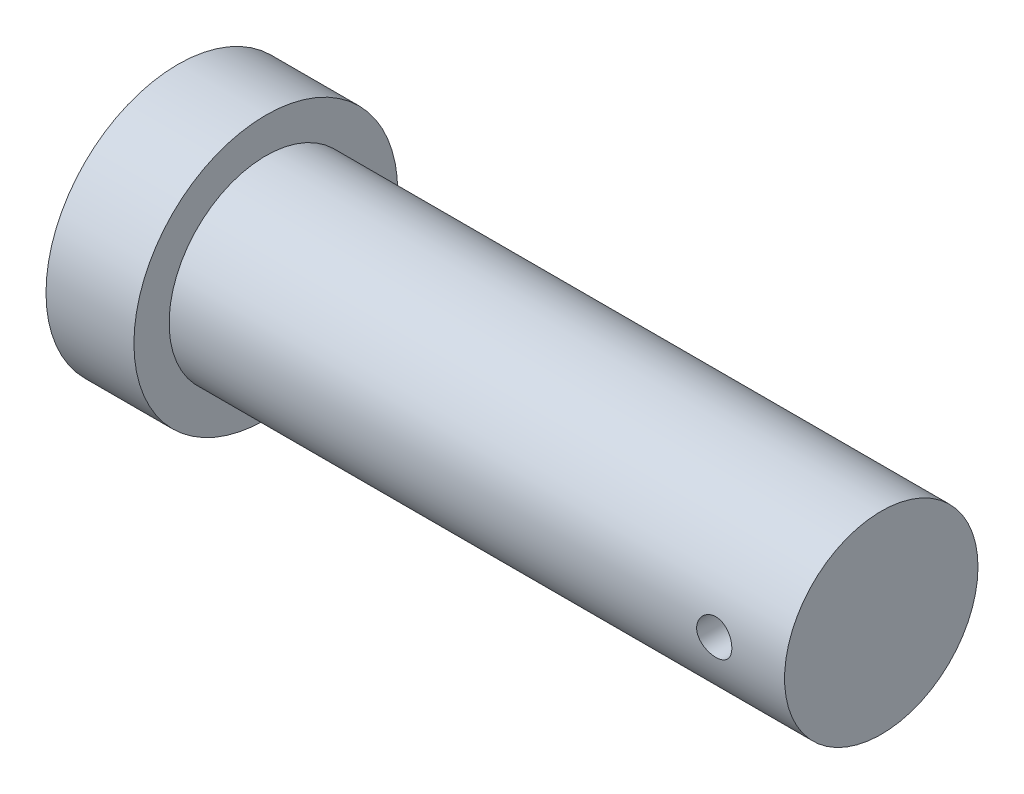
ISO-10303-21;
HEADER;
FILE_DESCRIPTION(('STEP AP214'),'2;1');
FILE_NAME('part.step','',(''),(''),'','','');
FILE_SCHEMA(('AUTOMOTIVE_DESIGN { 1 0 10303 214 1 1 1 1 }'));
ENDSEC;
DATA;
#1=APPLICATION_CONTEXT('core data for automotive mechanical design processes');
#2=APPLICATION_PROTOCOL_DEFINITION('international standard','automotive_design',2000,#1);
#3=PRODUCT_CONTEXT('',#1,'mechanical');
#4=PRODUCT('Part','Part','',(#3));
#5=PRODUCT_RELATED_PRODUCT_CATEGORY('part','',(#4));
#6=PRODUCT_DEFINITION_FORMATION('','',#4);
#7=PRODUCT_DEFINITION_CONTEXT('part definition',#1,'design');
#8=PRODUCT_DEFINITION('design','',#6,#7);
#9=PRODUCT_DEFINITION_SHAPE('','',#8);
#10=(LENGTH_UNIT() NAMED_UNIT(*) SI_UNIT(.MILLI.,.METRE.));
#11=(NAMED_UNIT(*) PLANE_ANGLE_UNIT() SI_UNIT($,.RADIAN.));
#12=(NAMED_UNIT(*) SI_UNIT($,.STERADIAN.) SOLID_ANGLE_UNIT());
#13=UNCERTAINTY_MEASURE_WITH_UNIT(LENGTH_MEASURE(1.E-05),#10,'distance_accuracy_value','');
#14=(GEOMETRIC_REPRESENTATION_CONTEXT(3) GLOBAL_UNCERTAINTY_ASSIGNED_CONTEXT((#13)) GLOBAL_UNIT_ASSIGNED_CONTEXT((#10,
#11,#12)) REPRESENTATION_CONTEXT('',''));
#15=CARTESIAN_POINT('',(0.,0.,0.));
#16=DIRECTION('',(0.,0.,1.));
#17=DIRECTION('',(1.,0.,0.));
#18=AXIS2_PLACEMENT_3D('',#15,#16,#17);
#19=CARTESIAN_POINT('',(-35.,0.,0.));
#20=DIRECTION('',(1.,0.,0.));
#21=DIRECTION('',(0.,0.,-1.));
#22=AXIS2_PLACEMENT_3D('',#19,#20,#21);
#23=CYLINDRICAL_SURFACE('',#22,5.5);
#24=CARTESIAN_POINT('',(-5.,0.,-5.5));
#25=CARTESIAN_POINT('',(-4.99999784066966,0.0556786358221865,-5.49999900363929));
#26=CARTESIAN_POINT('',(-4.99533412125867,0.111385724959101,-5.49914576366718));
#27=CARTESIAN_POINT('',(-4.97681326698754,0.221232203424155,-5.49582423750998));
#28=CARTESIAN_POINT('',(-4.96294817570931,0.275370193633037,-5.4933545536127));
#29=CARTESIAN_POINT('',(-4.92646143516451,0.380473786256874,-5.48707661617533));
#30=CARTESIAN_POINT('',(-4.90384748390512,0.431442131965088,-5.4832695396596));
#31=CARTESIAN_POINT('',(-4.85052633440411,0.528856001692251,-5.4747333574915));
#32=CARTESIAN_POINT('',(-4.8198198674059,0.575301933839522,-5.47000433515661));
#33=CARTESIAN_POINT('',(-4.75081704517865,0.662882220256192,-5.46008716749916));
#34=CARTESIAN_POINT('',(-4.71244707900962,0.703958113016729,-5.45489486298539));
#35=CARTESIAN_POINT('',(-4.62936482295509,0.779126786705395,-5.44466747605904));
#36=CARTESIAN_POINT('',(-4.58465209415543,0.813219083974887,-5.43963240455629));
#37=CARTESIAN_POINT('',(-4.48974363527011,0.873693475082384,-5.43024920104883));
#38=CARTESIAN_POINT('',(-4.43950973238481,0.900016566327779,-5.42590643555049));
#39=CARTESIAN_POINT('',(-4.33524067483802,0.943827734749892,-5.41845791638451));
#40=CARTESIAN_POINT('',(-4.28120582798748,0.961316526416375,-5.41535206268372));
#41=CARTESIAN_POINT('',(-4.1714926753217,0.986775988556574,-5.41077076758353));
#42=CARTESIAN_POINT('',(-4.11583870414519,0.994848332127223,-5.40927792311172));
#43=CARTESIAN_POINT('',(-4.00394779634272,1.00156124368344,-5.40803915716155));
#44=CARTESIAN_POINT('',(-3.94771090924199,1.00020260648321,-5.40829308847026));
#45=CARTESIAN_POINT('',(-3.83698404293349,0.988174672135,-5.4105033252459));
#46=CARTESIAN_POINT('',(-3.78248106605214,0.977620588495361,-5.41243856407131));
#47=CARTESIAN_POINT('',(-3.67603249081642,0.947682616700132,-5.41776030636955));
#48=CARTESIAN_POINT('',(-3.62408699532411,0.928298373715941,-5.42114686816159));
#49=CARTESIAN_POINT('',(-3.52388860461063,0.881136488946477,-5.42901190776358));
#50=CARTESIAN_POINT('',(-3.47565827866694,0.853311951857698,-5.43349645857176));
#51=CARTESIAN_POINT('',(-3.38450763152735,0.790092516870214,-5.44304811005858));
#52=CARTESIAN_POINT('',(-3.34158781867688,0.754696895117923,-5.44811526641734));
#53=CARTESIAN_POINT('',(-3.26161050177781,0.676716997091762,-5.45835320404273));
#54=CARTESIAN_POINT('',(-3.22464915578154,0.634034086328449,-5.46352440908234));
#55=CARTESIAN_POINT('',(-3.15839743325958,0.543022270346657,-5.47331875218544));
#56=CARTESIAN_POINT('',(-3.12910712518937,0.49469331474908,-5.4779418853578));
#57=CARTESIAN_POINT('',(-3.07901630510749,0.393663799248649,-5.4861276891267));
#58=CARTESIAN_POINT('',(-3.05822536565201,0.340958390197747,-5.48968916279611));
#59=CARTESIAN_POINT('',(-3.02581840375315,0.232724207231334,-5.49534102735441));
#60=CARTESIAN_POINT('',(-3.01420146571304,0.177195715658033,-5.49743156504548));
#61=CARTESIAN_POINT('',(-3.00060511904044,0.0657193247892502,-5.49988596689329));
#62=CARTESIAN_POINT('',(-2.99849388827296,0.00978800605446773,-5.50027344670572));
#63=CARTESIAN_POINT('',(-3.00361589909075,-0.101628619485483,-5.4993431512375));
#64=CARTESIAN_POINT('',(-3.01084871003587,-0.15711394672654,-5.49802545454355));
#65=CARTESIAN_POINT('',(-3.03434387478094,-0.265648548796378,-5.49384754316226));
#66=CARTESIAN_POINT('',(-3.05053993459141,-0.318712648729158,-5.49099865786081));
#67=CARTESIAN_POINT('',(-3.09143041426097,-0.421372356878305,-5.48407647561111));
#68=CARTESIAN_POINT('',(-3.11612538384885,-0.470967740480474,-5.48000309946218));
#69=CARTESIAN_POINT('',(-3.17360731890146,-0.565847623537467,-5.47102489792421));
#70=CARTESIAN_POINT('',(-3.20647534357796,-0.61108222604244,-5.466111908073));
#71=CARTESIAN_POINT('',(-3.27926018833555,-0.695441069111736,-5.45602144035543));
#72=CARTESIAN_POINT('',(-3.31917762470597,-0.73456477487166,-5.45084393939252));
#73=CARTESIAN_POINT('',(-3.40552344072425,-0.806088689438398,-5.44073019778822));
#74=CARTESIAN_POINT('',(-3.45202665326293,-0.838399183707092,-5.43579776060943));
#75=CARTESIAN_POINT('',(-3.54987809070324,-0.894749932760068,-5.4268075504051));
#76=CARTESIAN_POINT('',(-3.60122614234219,-0.918790483153975,-5.42274974611769));
#77=CARTESIAN_POINT('',(-3.70707537484587,-0.957789726208732,-5.41599772307739));
#78=CARTESIAN_POINT('',(-3.76156061536903,-0.972790539309199,-5.41329719008374));
#79=CARTESIAN_POINT('',(-3.87233149431553,-0.993415200892768,-5.40955063272695));
#80=CARTESIAN_POINT('',(-3.92861694242446,-0.999040037268145,-5.40850443405679));
#81=CARTESIAN_POINT('',(-4.04049268773182,-1.00072156831592,-5.40819346941308));
#82=CARTESIAN_POINT('',(-4.09608083571927,-0.996919685006163,-5.40890237272057));
#83=CARTESIAN_POINT('',(-4.20581181900871,-0.980164234564073,-5.41196354373513));
#84=CARTESIAN_POINT('',(-4.25995466174714,-0.967210714528588,-5.41431580298504));
#85=CARTESIAN_POINT('',(-4.36518809869768,-0.932577835792383,-5.42038786040457));
#86=CARTESIAN_POINT('',(-4.41628358011172,-0.910912905096161,-5.42410539649874));
#87=CARTESIAN_POINT('',(-4.51413722358237,-0.859487368324115,-5.43249088757423));
#88=CARTESIAN_POINT('',(-4.56089510442279,-0.829726237845036,-5.4371589041147));
#89=CARTESIAN_POINT('',(-4.64945643729781,-0.762457718313995,-5.44700162325733));
#90=CARTESIAN_POINT('',(-4.69118078493538,-0.724847077765498,-5.45218253915553));
#91=CARTESIAN_POINT('',(-4.7677735405061,-0.64316325711682,-5.46241996034325));
#92=CARTESIAN_POINT('',(-4.80264037019612,-0.599088593400466,-5.46747643675958));
#93=CARTESIAN_POINT('',(-4.86480014856174,-0.50528559482315,-5.47694487148596));
#94=CARTESIAN_POINT('',(-4.89202709259007,-0.455512924895249,-5.48135106586716));
#95=CARTESIAN_POINT('',(-4.93768960803703,-0.352036952543173,-5.48896630496674));
#96=CARTESIAN_POINT('',(-4.95613357963916,-0.298337462743336,-5.49217649292367));
#97=CARTESIAN_POINT('',(-4.9798877151511,-0.203720874729203,-5.49637035188245));
#98=CARTESIAN_POINT('',(-4.98741716648018,-0.163362713638245,-5.49772390136792));
#99=CARTESIAN_POINT('',(-4.99747404689745,-0.0820081710661018,-5.49953908216522));
#100=CARTESIAN_POINT('',(-5.00000159052089,-0.0410118042204166,-5.50000073389999));
#101=CARTESIAN_POINT('',(-5.,0.,-5.5));
#102=B_SPLINE_CURVE_WITH_KNOTS('',3,(#24,#25,#26,#27,#28,#29,#30,#31,#32,#33,#34,#35,#36,#37,
#38,#39,#40,#41,#42,#43,#44,#45,#46,#47,#48,#49,#50,#51,#52,#53,#54,#55,#56,#57,#58,#59,#60,#61,
#62,#63,#64,#65,#66,#67,#68,#69,#70,#71,#72,#73,#74,#75,#76,#77,#78,#79,#80,#81,#82,#83,#84,#85,
#86,#87,#88,#89,#90,#91,#92,#93,#94,#95,#96,#97,#98,#99,#100,#101),.UNSPECIFIED.,.T.,.F.,(4,2,2,
2,2,2,2,2,2,2,2,2,2,2,2,2,2,2,2,2,2,2,2,2,2,2,2,2,2,2,2,2,2,2,2,2,2,2,4),(0.,0.166885945776166,
0.333916386036295,0.500800191433372,0.667668922300751,0.836225072984426,1.00479289331539,
1.17460976101825,1.34441289227865,1.51236510586322,1.68030316512101,1.84616683645448,
2.01203717339435,2.17884653230813,2.34567184660627,2.51496605220936,2.68426176852323,
2.85374763511906,3.02321658430726,3.19032800498682,3.35743172425399,3.52331571642715,
3.6892104403711,3.85682113397833,4.02444648808062,4.19415753065229,4.36386250626237,
4.53277050538078,4.70166070651801,4.86803254865186,5.03440353459656,5.20050010129481,
5.36660742888452,5.53505557265019,5.70354243914731,5.87344302271463,6.04318078249083,
6.1661085511478,6.28903350493382),.UNSPECIFIED.);
#103=CARTESIAN_POINT('',(-5.,0.,-5.5));
#104=VERTEX_POINT('',#103);
#105=EDGE_CURVE('E41',#104,#104,#102,.T.);
#106=ORIENTED_EDGE('',*,*,#105,.F.);
#107=EDGE_LOOP('',(#106));
#108=FACE_BOUND('',#107,.T.);
#109=CARTESIAN_POINT('',(-3.,0.,5.5));
#110=CARTESIAN_POINT('',(-3.00000215933034,0.0556786358221865,5.49999900363929));
#111=CARTESIAN_POINT('',(-3.00466587874133,0.111385724959101,5.49914576366718));
#112=CARTESIAN_POINT('',(-3.02318673301246,0.221232203424155,5.49582423750998));
#113=CARTESIAN_POINT('',(-3.03705182429069,0.275370193633037,5.4933545536127));
#114=CARTESIAN_POINT('',(-3.07353856483549,0.380473786256874,5.48707661617533));
#115=CARTESIAN_POINT('',(-3.09615251609488,0.431442131965088,5.4832695396596));
#116=CARTESIAN_POINT('',(-3.14947366559589,0.528856001692251,5.4747333574915));
#117=CARTESIAN_POINT('',(-3.1801801325941,0.575301933839523,5.47000433515661));
#118=CARTESIAN_POINT('',(-3.24918295482135,0.662882220256192,5.46008716749916));
#119=CARTESIAN_POINT('',(-3.28755292099038,0.703958113016729,5.45489486298539));
#120=CARTESIAN_POINT('',(-3.37063517704491,0.779126786705395,5.44466747605904));
#121=CARTESIAN_POINT('',(-3.41534790584457,0.813219083974887,5.43963240455629));
#122=CARTESIAN_POINT('',(-3.51025636472989,0.873693475082384,5.43024920104883));
#123=CARTESIAN_POINT('',(-3.56049026761519,0.900016566327779,5.42590643555049));
#124=CARTESIAN_POINT('',(-3.66475932516198,0.943827734749892,5.41845791638451));
#125=CARTESIAN_POINT('',(-3.71879417201252,0.961316526416375,5.41535206268372));
#126=CARTESIAN_POINT('',(-3.8285073246783,0.986775988556575,5.41077076758353));
#127=CARTESIAN_POINT('',(-3.88416129585481,0.994848332127224,5.40927792311172));
#128=CARTESIAN_POINT('',(-3.99605220365728,1.00156124368344,5.40803915716155));
#129=CARTESIAN_POINT('',(-4.05228909075802,1.00020260648321,5.40829308847026));
#130=CARTESIAN_POINT('',(-4.16301595706651,0.988174672135,5.4105033252459));
#131=CARTESIAN_POINT('',(-4.21751893394786,0.977620588495361,5.41243856407131));
#132=CARTESIAN_POINT('',(-4.32396750918358,0.947682616700132,5.41776030636955));
#133=CARTESIAN_POINT('',(-4.3759130046759,0.928298373715941,5.42114686816159));
#134=CARTESIAN_POINT('',(-4.47611139538937,0.881136488946477,5.42901190776358));
#135=CARTESIAN_POINT('',(-4.52434172133306,0.853311951857698,5.43349645857176));
#136=CARTESIAN_POINT('',(-4.61549236847265,0.790092516870214,5.44304811005858));
#137=CARTESIAN_POINT('',(-4.65841218132312,0.754696895117923,5.44811526641734));
#138=CARTESIAN_POINT('',(-4.73838949822219,0.676716997091762,5.45835320404273));
#139=CARTESIAN_POINT('',(-4.77535084421846,0.634034086328449,5.46352440908234));
#140=CARTESIAN_POINT('',(-4.84160256674042,0.543022270346656,5.47331875218544));
#141=CARTESIAN_POINT('',(-4.87089287481063,0.494693314749078,5.4779418853578));
#142=CARTESIAN_POINT('',(-4.92098369489251,0.393663799248648,5.4861276891267));
#143=CARTESIAN_POINT('',(-4.94177463434799,0.340958390197746,5.48968916279611));
#144=CARTESIAN_POINT('',(-4.97418159624685,0.232724207231333,5.49534102735441));
#145=CARTESIAN_POINT('',(-4.98579853428696,0.177195715658032,5.49743156504548));
#146=CARTESIAN_POINT('',(-4.99939488095956,0.0657193247892495,5.49988596689329));
#147=CARTESIAN_POINT('',(-5.00150611172704,0.00978800605446691,5.50027344670572));
#148=CARTESIAN_POINT('',(-4.99638410090925,-0.101628619485484,5.4993431512375));
#149=CARTESIAN_POINT('',(-4.98915128996413,-0.157113946726541,5.49802545454355));
#150=CARTESIAN_POINT('',(-4.96565612521906,-0.265648548796379,5.49384754316226));
#151=CARTESIAN_POINT('',(-4.94946006540859,-0.318712648729159,5.49099865786081));
#152=CARTESIAN_POINT('',(-4.90856958573903,-0.421372356878306,5.48407647561111));
#153=CARTESIAN_POINT('',(-4.88387461615115,-0.470967740480475,5.48000309946218));
#154=CARTESIAN_POINT('',(-4.82639268109854,-0.565847623537468,5.47102489792421));
#155=CARTESIAN_POINT('',(-4.79352465642204,-0.611082226042441,5.466111908073));
#156=CARTESIAN_POINT('',(-4.72073981166445,-0.695441069111736,5.45602144035543));
#157=CARTESIAN_POINT('',(-4.68082237529403,-0.734564774871661,5.45084393939252));
#158=CARTESIAN_POINT('',(-4.59447655927575,-0.806088689438399,5.44073019778822));
#159=CARTESIAN_POINT('',(-4.54797334673707,-0.838399183707093,5.43579776060943));
#160=CARTESIAN_POINT('',(-4.45012190929676,-0.894749932760069,5.4268075504051));
#161=CARTESIAN_POINT('',(-4.39877385765781,-0.918790483153975,5.42274974611769));
#162=CARTESIAN_POINT('',(-4.29292462515413,-0.957789726208732,5.41599772307739));
#163=CARTESIAN_POINT('',(-4.23843938463097,-0.9727905393092,5.41329719008374));
#164=CARTESIAN_POINT('',(-4.12766850568447,-0.993415200892769,5.40955063272695));
#165=CARTESIAN_POINT('',(-4.07138305757554,-0.999040037268146,5.40850443405679));
#166=CARTESIAN_POINT('',(-3.95950731226818,-1.00072156831592,5.40819346941308));
#167=CARTESIAN_POINT('',(-3.90391916428073,-0.996919685006162,5.40890237272057));
#168=CARTESIAN_POINT('',(-3.79418818099129,-0.980164234564073,5.41196354373513));
#169=CARTESIAN_POINT('',(-3.74004533825286,-0.967210714528588,5.41431580298504));
#170=CARTESIAN_POINT('',(-3.63481190130232,-0.932577835792382,5.42038786040457));
#171=CARTESIAN_POINT('',(-3.58371641988828,-0.910912905096161,5.42410539649874));
#172=CARTESIAN_POINT('',(-3.48586277641763,-0.859487368324114,5.43249088757423));
#173=CARTESIAN_POINT('',(-3.43910489557721,-0.829726237845035,5.4371589041147));
#174=CARTESIAN_POINT('',(-3.35054356270219,-0.762457718313994,5.44700162325733));
#175=CARTESIAN_POINT('',(-3.30881921506462,-0.724847077765497,5.45218253915553));
#176=CARTESIAN_POINT('',(-3.2322264594939,-0.643163257116819,5.46241996034325));
#177=CARTESIAN_POINT('',(-3.19735962980388,-0.599088593400465,5.46747643675958));
#178=CARTESIAN_POINT('',(-3.13519985143826,-0.505285594823149,5.47694487148596));
#179=CARTESIAN_POINT('',(-3.10797290740993,-0.455512924895248,5.48135106586716));
#180=CARTESIAN_POINT('',(-3.06231039196297,-0.352036952543172,5.48896630496674));
#181=CARTESIAN_POINT('',(-3.04386642036084,-0.298337462743335,5.49217649292367));
#182=CARTESIAN_POINT('',(-3.0201122848489,-0.203720874729202,5.49637035188245));
#183=CARTESIAN_POINT('',(-3.01258283351982,-0.163362713638244,5.49772390136792));
#184=CARTESIAN_POINT('',(-3.00252595310255,-0.0820081710661011,5.49953908216522));
#185=CARTESIAN_POINT('',(-2.99999840947911,-0.0410118042204163,5.50000073389999));
#186=CARTESIAN_POINT('',(-3.,0.,5.5));
#187=B_SPLINE_CURVE_WITH_KNOTS('',3,(#109,#110,#111,#112,#113,#114,#115,#116,#117,#118,#119,
#120,#121,#122,#123,#124,#125,#126,#127,#128,#129,#130,#131,#132,#133,#134,#135,#136,#137,#138,
#139,#140,#141,#142,#143,#144,#145,#146,#147,#148,#149,#150,#151,#152,#153,#154,#155,#156,#157,
#158,#159,#160,#161,#162,#163,#164,#165,#166,#167,#168,#169,#170,#171,#172,#173,#174,#175,#176,
#177,#178,#179,#180,#181,#182,#183,#184,#185,#186),.UNSPECIFIED.,.T.,.F.,(4,2,2,2,2,2,2,2,2,2,2,
2,2,2,2,2,2,2,2,2,2,2,2,2,2,2,2,2,2,2,2,2,2,2,2,2,2,2,4),(0.,0.166885945776166,
0.333916386036295,0.500800191433373,0.667668922300752,0.836225072984426,1.00479289331539,
1.17460976101825,1.34441289227865,1.51236510586323,1.68030316512101,1.84616683645448,
2.01203717339435,2.17884653230813,2.34567184660627,2.51496605220936,2.68426176852323,
2.85374763511906,3.02321658430726,3.19032800498682,3.35743172425399,3.52331571642715,
3.6892104403711,3.85682113397833,4.02444648808062,4.19415753065229,4.36386250626237,
4.53277050538079,4.70166070651801,4.86803254865186,5.03440353459656,5.20050010129481,
5.36660742888452,5.53505557265019,5.70354243914731,5.87344302271463,6.04318078249083,
6.1661085511478,6.28903350493382),.UNSPECIFIED.);
#188=CARTESIAN_POINT('',(-3.,0.,5.5));
#189=VERTEX_POINT('',#188);
#190=EDGE_CURVE('E57',#189,#189,#187,.T.);
#191=ORIENTED_EDGE('',*,*,#190,.F.);
#192=EDGE_LOOP('',(#191));
#193=FACE_BOUND('',#192,.T.);
#194=CARTESIAN_POINT('',(-35.,0.,0.));
#195=DIRECTION('',(1.,0.,0.));
#196=DIRECTION('',(0.,0.,-1.));
#197=AXIS2_PLACEMENT_3D('',#194,#195,#196);
#198=CIRCLE('',#197,5.5);
#199=CARTESIAN_POINT('',(-35.,0.,-5.5));
#200=VERTEX_POINT('',#199);
#201=EDGE_CURVE('E49',#200,#200,#198,.T.);
#202=ORIENTED_EDGE('',*,*,#201,.T.);
#203=EDGE_LOOP('',(#202));
#204=FACE_BOUND('',#203,.T.);
#205=CARTESIAN_POINT('',(0.,0.,0.));
#206=DIRECTION('',(1.,0.,0.));
#207=DIRECTION('',(0.,0.,-1.));
#208=AXIS2_PLACEMENT_3D('',#205,#206,#207);
#209=CIRCLE('',#208,5.5);
#210=CARTESIAN_POINT('',(0.,0.,-5.5));
#211=VERTEX_POINT('',#210);
#212=EDGE_CURVE('E10',#211,#211,#209,.T.);
#213=ORIENTED_EDGE('',*,*,#212,.F.);
#214=EDGE_LOOP('',(#213));
#215=FACE_BOUND('',#214,.T.);
#216=ADVANCED_FACE('F37',(#108,#193,#204,#215),#23,.T.);
#217=CARTESIAN_POINT('',(0.,0.,0.));
#218=DIRECTION('',(1.,0.,0.));
#219=DIRECTION('',(0.,0.,-1.));
#220=AXIS2_PLACEMENT_3D('',#217,#218,#219);
#221=PLANE('',#220);
#222=ORIENTED_EDGE('',*,*,#212,.T.);
#223=EDGE_LOOP('',(#222));
#224=FACE_BOUND('',#223,.T.);
#225=ADVANCED_FACE('F78',(#224),#221,.T.);
#226=CARTESIAN_POINT('',(-40.,0.,0.));
#227=DIRECTION('',(1.,0.,0.));
#228=DIRECTION('',(0.,0.,-1.));
#229=AXIS2_PLACEMENT_3D('',#226,#227,#228);
#230=CYLINDRICAL_SURFACE('',#229,7.5);
#231=CARTESIAN_POINT('',(-40.,0.,0.));
#232=DIRECTION('',(-1.,0.,0.));
#233=DIRECTION('',(0.,0.,1.));
#234=AXIS2_PLACEMENT_3D('',#231,#232,#233);
#235=CIRCLE('',#234,7.5);
#236=CARTESIAN_POINT('',(-40.,0.,7.5));
#237=VERTEX_POINT('',#236);
#238=EDGE_CURVE('E54',#237,#237,#235,.T.);
#239=ORIENTED_EDGE('',*,*,#238,.F.);
#240=EDGE_LOOP('',(#239));
#241=FACE_BOUND('',#240,.T.);
#242=CARTESIAN_POINT('',(-35.,0.,0.));
#243=DIRECTION('',(-1.,0.,0.));
#244=DIRECTION('',(0.,0.,1.));
#245=AXIS2_PLACEMENT_3D('',#242,#243,#244);
#246=CIRCLE('',#245,7.5);
#247=CARTESIAN_POINT('',(-35.,0.,7.5));
#248=VERTEX_POINT('',#247);
#249=EDGE_CURVE('E97',#248,#248,#246,.T.);
#250=ORIENTED_EDGE('',*,*,#249,.T.);
#251=EDGE_LOOP('',(#250));
#252=FACE_BOUND('',#251,.T.);
#253=ADVANCED_FACE('F72',(#241,#252),#230,.T.);
#254=CARTESIAN_POINT('',(-40.,0.,0.));
#255=DIRECTION('',(-1.,0.,0.));
#256=DIRECTION('',(0.,0.,1.));
#257=AXIS2_PLACEMENT_3D('',#254,#255,#256);
#258=PLANE('',#257);
#259=ORIENTED_EDGE('',*,*,#238,.T.);
#260=EDGE_LOOP('',(#259));
#261=FACE_BOUND('',#260,.T.);
#262=ADVANCED_FACE('F68',(#261),#258,.T.);
#263=CARTESIAN_POINT('',(-35.,0.,0.));
#264=DIRECTION('',(-1.,0.,0.));
#265=DIRECTION('',(0.,0.,1.));
#266=AXIS2_PLACEMENT_3D('',#263,#264,#265);
#267=PLANE('',#266);
#268=ORIENTED_EDGE('',*,*,#201,.F.);
#269=EDGE_LOOP('',(#268));
#270=FACE_BOUND('',#269,.T.);
#271=ORIENTED_EDGE('',*,*,#249,.F.);
#272=EDGE_LOOP('',(#271));
#273=FACE_BOUND('',#272,.T.);
#274=ADVANCED_FACE('F66',(#270,#273),#267,.F.);
#275=CARTESIAN_POINT('',(-4.,0.,-7.5));
#276=DIRECTION('',(0.,0.,1.));
#277=DIRECTION('',(1.,0.,0.));
#278=AXIS2_PLACEMENT_3D('',#275,#276,#277);
#279=CYLINDRICAL_SURFACE('',#278,1.);
#280=ORIENTED_EDGE('',*,*,#105,.T.);
#281=EDGE_LOOP('',(#280));
#282=FACE_BOUND('',#281,.T.);
#283=ORIENTED_EDGE('',*,*,#190,.T.);
#284=EDGE_LOOP('',(#283));
#285=FACE_BOUND('',#284,.T.);
#286=ADVANCED_FACE('F62',(#282,#285),#279,.F.);
#287=CLOSED_SHELL('',(#216,#225,#253,#262,#274,#286));
#288=MANIFOLD_SOLID_BREP('B2',#287);
#289=ADVANCED_BREP_SHAPE_REPRESENTATION('',(#18,#288),#14);
#290=SHAPE_DEFINITION_REPRESENTATION(#9,#289);
ENDSEC;
END-ISO-10303-21;
